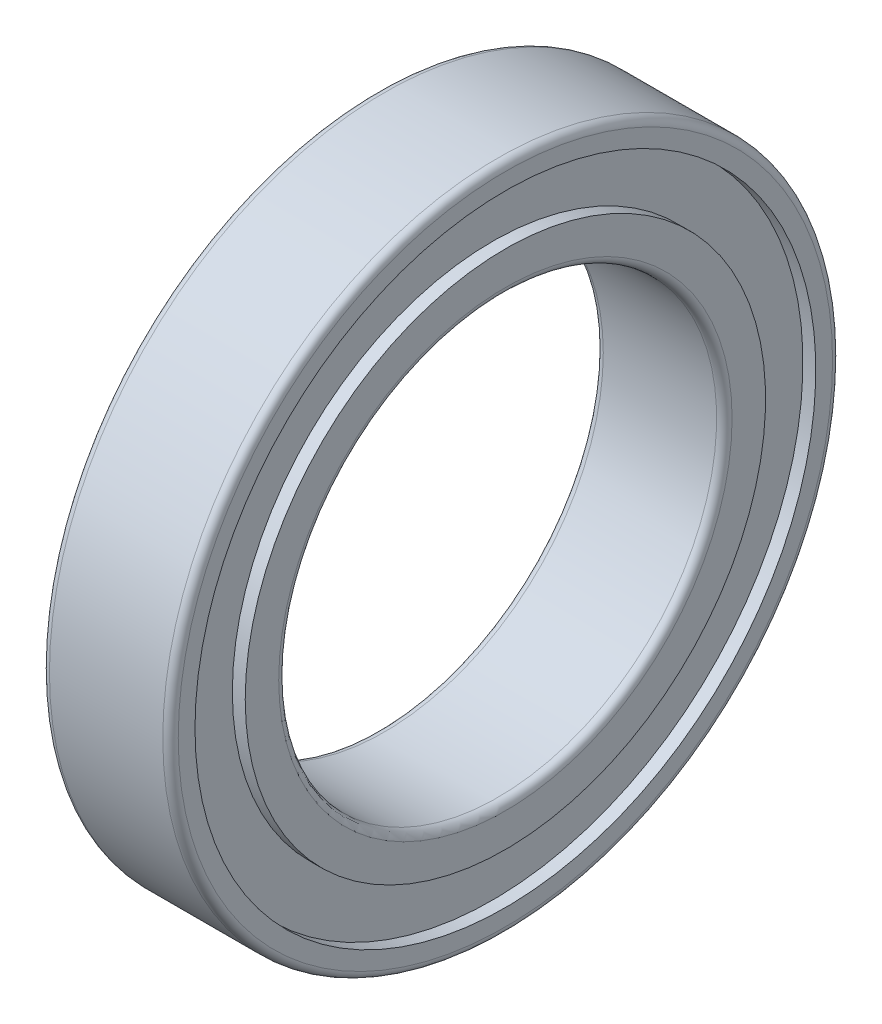
ISO-10303-21;
HEADER;
FILE_DESCRIPTION(('STEP AP214'),'2;1');
FILE_NAME('part.step','',(''),(''),'','','');
FILE_SCHEMA(('AUTOMOTIVE_DESIGN { 1 0 10303 214 1 1 1 1 }'));
ENDSEC;
DATA;
#1=APPLICATION_CONTEXT('core data for automotive mechanical design processes');
#2=APPLICATION_PROTOCOL_DEFINITION('international standard','automotive_design',2000,#1);
#3=PRODUCT_CONTEXT('',#1,'mechanical');
#4=PRODUCT('Part','Part','',(#3));
#5=PRODUCT_RELATED_PRODUCT_CATEGORY('part','',(#4));
#6=PRODUCT_DEFINITION_FORMATION('','',#4);
#7=PRODUCT_DEFINITION_CONTEXT('part definition',#1,'design');
#8=PRODUCT_DEFINITION('design','',#6,#7);
#9=PRODUCT_DEFINITION_SHAPE('','',#8);
#10=(LENGTH_UNIT() NAMED_UNIT(*) SI_UNIT(.MILLI.,.METRE.));
#11=(NAMED_UNIT(*) PLANE_ANGLE_UNIT() SI_UNIT($,.RADIAN.));
#12=(NAMED_UNIT(*) SI_UNIT($,.STERADIAN.) SOLID_ANGLE_UNIT());
#13=UNCERTAINTY_MEASURE_WITH_UNIT(LENGTH_MEASURE(1.E-05),#10,'distance_accuracy_value','');
#14=(GEOMETRIC_REPRESENTATION_CONTEXT(3) GLOBAL_UNCERTAINTY_ASSIGNED_CONTEXT((#13)) GLOBAL_UNIT_ASSIGNED_CONTEXT((#10,
#11,#12)) REPRESENTATION_CONTEXT('',''));
#15=CARTESIAN_POINT('',(0.,0.,0.));
#16=DIRECTION('',(0.,0.,1.));
#17=DIRECTION('',(1.,0.,0.));
#18=AXIS2_PLACEMENT_3D('',#15,#16,#17);
#19=CARTESIAN_POINT('',(0.,0.,0.));
#20=DIRECTION('',(-1.,0.,0.));
#21=DIRECTION('',(0.,0.,1.));
#22=AXIS2_PLACEMENT_3D('',#19,#20,#21);
#23=CYLINDRICAL_SURFACE('',#22,8.5);
#24=CARTESIAN_POINT('',(4.7,0.,0.));
#25=DIRECTION('',(-1.,0.,0.));
#26=DIRECTION('',(0.,0.,1.));
#27=AXIS2_PLACEMENT_3D('',#24,#25,#26);
#28=CIRCLE('',#27,8.5);
#29=CARTESIAN_POINT('',(4.7,0.,8.5));
#30=VERTEX_POINT('',#29);
#31=EDGE_CURVE('E259',#30,#30,#28,.T.);
#32=ORIENTED_EDGE('',*,*,#31,.F.);
#33=EDGE_LOOP('',(#32));
#34=FACE_BOUND('',#33,.T.);
#35=CARTESIAN_POINT('',(0.3,0.,0.));
#36=DIRECTION('',(1.,0.,0.));
#37=DIRECTION('',(0.,0.,-1.));
#38=AXIS2_PLACEMENT_3D('',#35,#36,#37);
#39=CIRCLE('',#38,8.5);
#40=CARTESIAN_POINT('',(0.3,0.,-8.5));
#41=VERTEX_POINT('',#40);
#42=EDGE_CURVE('E64',#41,#41,#39,.T.);
#43=ORIENTED_EDGE('',*,*,#42,.F.);
#44=EDGE_LOOP('',(#43));
#45=FACE_BOUND('',#44,.T.);
#46=ADVANCED_FACE('F17',(#34,#45),#23,.F.);
#47=CARTESIAN_POINT('',(4.7,0.,0.));
#48=DIRECTION('',(-1.,0.,0.));
#49=DIRECTION('',(0.,0.,1.));
#50=AXIS2_PLACEMENT_3D('',#47,#48,#49);
#51=TOROIDAL_SURFACE('',#50,8.8,0.3);
#52=CARTESIAN_POINT('',(5.,0.,0.));
#53=DIRECTION('',(1.,0.,0.));
#54=DIRECTION('',(0.,0.,1.));
#55=AXIS2_PLACEMENT_3D('',#52,#53,#54);
#56=CIRCLE('',#55,8.8);
#57=CARTESIAN_POINT('',(5.,0.,8.8));
#58=VERTEX_POINT('',#57);
#59=CARTESIAN_POINT('',(5.,0.,-8.8));
#60=VERTEX_POINT('',#59);
#61=EDGE_CURVE('E59',#58,#60,#56,.T.);
#62=ORIENTED_EDGE('',*,*,#61,.T.);
#63=CARTESIAN_POINT('',(5.,0.,0.));
#64=DIRECTION('',(1.,0.,0.));
#65=DIRECTION('',(0.,0.,-1.));
#66=AXIS2_PLACEMENT_3D('',#63,#64,#65);
#67=CIRCLE('',#66,8.8);
#68=EDGE_CURVE('E56',#60,#58,#67,.T.);
#69=ORIENTED_EDGE('',*,*,#68,.T.);
#70=EDGE_LOOP('',(#62,#69));
#71=FACE_BOUND('',#70,.T.);
#72=ORIENTED_EDGE('',*,*,#31,.T.);
#73=EDGE_LOOP('',(#72));
#74=FACE_BOUND('',#73,.T.);
#75=ADVANCED_FACE('F60',(#71,#74),#51,.T.);
#76=CARTESIAN_POINT('',(0.3,0.,0.));
#77=DIRECTION('',(1.,0.,0.));
#78=DIRECTION('',(0.,0.,-1.));
#79=AXIS2_PLACEMENT_3D('',#76,#77,#78);
#80=TOROIDAL_SURFACE('',#79,8.8,0.3);
#81=CARTESIAN_POINT('',(0.,0.,0.));
#82=DIRECTION('',(-1.,0.,0.));
#83=DIRECTION('',(0.,0.,-1.));
#84=AXIS2_PLACEMENT_3D('',#81,#82,#83);
#85=CIRCLE('',#84,8.8);
#86=CARTESIAN_POINT('',(0.,0.,-8.8));
#87=VERTEX_POINT('',#86);
#88=CARTESIAN_POINT('',(0.,0.,8.8));
#89=VERTEX_POINT('',#88);
#90=EDGE_CURVE('E68',#87,#89,#85,.T.);
#91=ORIENTED_EDGE('',*,*,#90,.T.);
#92=CARTESIAN_POINT('',(0.,0.,0.));
#93=DIRECTION('',(-1.,0.,0.));
#94=DIRECTION('',(0.,0.,1.));
#95=AXIS2_PLACEMENT_3D('',#92,#93,#94);
#96=CIRCLE('',#95,8.8);
#97=EDGE_CURVE('E222',#89,#87,#96,.T.);
#98=ORIENTED_EDGE('',*,*,#97,.T.);
#99=EDGE_LOOP('',(#91,#98));
#100=FACE_BOUND('',#99,.T.);
#101=ORIENTED_EDGE('',*,*,#42,.T.);
#102=EDGE_LOOP('',(#101));
#103=FACE_BOUND('',#102,.T.);
#104=ADVANCED_FACE('F89',(#100,#103),#80,.T.);
#105=CARTESIAN_POINT('',(5.,8.5,0.));
#106=DIRECTION('',(-1.,0.,0.));
#107=DIRECTION('',(0.,0.,1.));
#108=AXIS2_PLACEMENT_3D('',#105,#106,#107);
#109=PLANE('',#108);
#110=CARTESIAN_POINT('',(5.,0.,0.));
#111=DIRECTION('',(-1.,0.,0.));
#112=DIRECTION('',(0.,0.,1.));
#113=AXIS2_PLACEMENT_3D('',#110,#111,#112);
#114=CIRCLE('',#113,10.1);
#115=CARTESIAN_POINT('',(5.,0.,10.1));
#116=VERTEX_POINT('',#115);
#117=EDGE_CURVE('E230',#116,#116,#114,.T.);
#118=ORIENTED_EDGE('',*,*,#117,.F.);
#119=EDGE_LOOP('',(#118));
#120=FACE_BOUND('',#119,.T.);
#121=ORIENTED_EDGE('',*,*,#61,.F.);
#122=ORIENTED_EDGE('',*,*,#68,.F.);
#123=EDGE_LOOP('',(#121,#122));
#124=FACE_BOUND('',#123,.T.);
#125=ADVANCED_FACE('F67',(#120,#124),#109,.F.);
#126=CARTESIAN_POINT('',(0.,8.5,0.));
#127=DIRECTION('',(1.,0.,0.));
#128=DIRECTION('',(0.,0.,-1.));
#129=AXIS2_PLACEMENT_3D('',#126,#127,#128);
#130=PLANE('',#129);
#131=CARTESIAN_POINT('',(0.,0.,0.));
#132=DIRECTION('',(-1.,0.,0.));
#133=DIRECTION('',(0.,0.,1.));
#134=AXIS2_PLACEMENT_3D('',#131,#132,#133);
#135=CIRCLE('',#134,10.1);
#136=CARTESIAN_POINT('',(0.,0.,10.1));
#137=VERTEX_POINT('',#136);
#138=EDGE_CURVE('E232',#137,#137,#135,.F.);
#139=ORIENTED_EDGE('',*,*,#138,.F.);
#140=EDGE_LOOP('',(#139));
#141=FACE_BOUND('',#140,.T.);
#142=ORIENTED_EDGE('',*,*,#90,.F.);
#143=ORIENTED_EDGE('',*,*,#97,.F.);
#144=EDGE_LOOP('',(#142,#143));
#145=FACE_BOUND('',#144,.T.);
#146=ADVANCED_FACE('F88',(#141,#145),#130,.F.);
#147=CARTESIAN_POINT('',(0.,0.,0.));
#148=DIRECTION('',(-1.,0.,0.));
#149=DIRECTION('',(0.,0.,1.));
#150=AXIS2_PLACEMENT_3D('',#147,#148,#149);
#151=CYLINDRICAL_SURFACE('',#150,10.1);
#152=CARTESIAN_POINT('',(4.5,0.,0.));
#153=DIRECTION('',(-1.,0.,0.));
#154=DIRECTION('',(0.,0.,1.));
#155=AXIS2_PLACEMENT_3D('',#152,#153,#154);
#156=CIRCLE('',#155,10.1);
#157=CARTESIAN_POINT('',(4.5,0.,10.1));
#158=VERTEX_POINT('',#157);
#159=EDGE_CURVE('E237',#158,#158,#156,.F.);
#160=ORIENTED_EDGE('',*,*,#159,.T.);
#161=EDGE_LOOP('',(#160));
#162=FACE_BOUND('',#161,.T.);
#163=ORIENTED_EDGE('',*,*,#117,.T.);
#164=EDGE_LOOP('',(#163));
#165=FACE_BOUND('',#164,.T.);
#166=ADVANCED_FACE('F272',(#162,#165),#151,.T.);
#167=CARTESIAN_POINT('',(0.,0.,0.));
#168=DIRECTION('',(-1.,0.,0.));
#169=DIRECTION('',(0.,0.,1.));
#170=AXIS2_PLACEMENT_3D('',#167,#168,#169);
#171=CYLINDRICAL_SURFACE('',#170,10.1);
#172=ORIENTED_EDGE('',*,*,#138,.T.);
#173=EDGE_LOOP('',(#172));
#174=FACE_BOUND('',#173,.T.);
#175=CARTESIAN_POINT('',(0.5,0.,0.));
#176=DIRECTION('',(-1.,0.,0.));
#177=DIRECTION('',(0.,0.,1.));
#178=AXIS2_PLACEMENT_3D('',#175,#176,#177);
#179=CIRCLE('',#178,10.1);
#180=CARTESIAN_POINT('',(0.5,0.,10.1));
#181=VERTEX_POINT('',#180);
#182=EDGE_CURVE('E267',#181,#181,#179,.T.);
#183=ORIENTED_EDGE('',*,*,#182,.T.);
#184=EDGE_LOOP('',(#183));
#185=FACE_BOUND('',#184,.T.);
#186=ADVANCED_FACE('F278',(#174,#185),#171,.T.);
#187=CARTESIAN_POINT('',(4.5,12.05,0.));
#188=DIRECTION('',(-1.,0.,0.));
#189=DIRECTION('',(0.,0.,1.));
#190=AXIS2_PLACEMENT_3D('',#187,#188,#189);
#191=PLANE('',#190);
#192=ORIENTED_EDGE('',*,*,#159,.F.);
#193=EDGE_LOOP('',(#192));
#194=FACE_BOUND('',#193,.T.);
#195=CARTESIAN_POINT('',(4.5,0.,0.));
#196=DIRECTION('',(-1.,0.,0.));
#197=DIRECTION('',(0.,0.,1.));
#198=AXIS2_PLACEMENT_3D('',#195,#196,#197);
#199=CIRCLE('',#198,12.05);
#200=CARTESIAN_POINT('',(4.5,0.,12.05));
#201=VERTEX_POINT('',#200);
#202=EDGE_CURVE('E264',#201,#201,#199,.F.);
#203=ORIENTED_EDGE('',*,*,#202,.T.);
#204=EDGE_LOOP('',(#203));
#205=FACE_BOUND('',#204,.T.);
#206=ADVANCED_FACE('F274',(#194,#205),#191,.F.);
#207=CARTESIAN_POINT('',(0.5,10.1,0.));
#208=DIRECTION('',(1.,0.,0.));
#209=DIRECTION('',(0.,0.,-1.));
#210=AXIS2_PLACEMENT_3D('',#207,#208,#209);
#211=PLANE('',#210);
#212=CARTESIAN_POINT('',(0.5,0.,0.));
#213=DIRECTION('',(-1.,0.,0.));
#214=DIRECTION('',(0.,0.,1.));
#215=AXIS2_PLACEMENT_3D('',#212,#213,#214);
#216=CIRCLE('',#215,12.05);
#217=CARTESIAN_POINT('',(0.5,0.,12.05));
#218=VERTEX_POINT('',#217);
#219=EDGE_CURVE('E256',#218,#218,#216,.T.);
#220=ORIENTED_EDGE('',*,*,#219,.T.);
#221=EDGE_LOOP('',(#220));
#222=FACE_BOUND('',#221,.T.);
#223=ORIENTED_EDGE('',*,*,#182,.F.);
#224=EDGE_LOOP('',(#223));
#225=FACE_BOUND('',#224,.T.);
#226=ADVANCED_FACE('F277',(#222,#225),#211,.F.);
#227=CARTESIAN_POINT('',(0.,0.,0.));
#228=DIRECTION('',(-1.,0.,0.));
#229=DIRECTION('',(0.,0.,1.));
#230=AXIS2_PLACEMENT_3D('',#227,#228,#229);
#231=CYLINDRICAL_SURFACE('',#230,12.05);
#232=CARTESIAN_POINT('',(5.,0.,0.));
#233=DIRECTION('',(-1.,0.,0.));
#234=DIRECTION('',(0.,0.,1.));
#235=AXIS2_PLACEMENT_3D('',#232,#233,#234);
#236=CIRCLE('',#235,12.05);
#237=CARTESIAN_POINT('',(5.,0.,12.05));
#238=VERTEX_POINT('',#237);
#239=EDGE_CURVE('E251',#238,#238,#236,.F.);
#240=ORIENTED_EDGE('',*,*,#239,.T.);
#241=EDGE_LOOP('',(#240));
#242=FACE_BOUND('',#241,.T.);
#243=ORIENTED_EDGE('',*,*,#202,.F.);
#244=EDGE_LOOP('',(#243));
#245=FACE_BOUND('',#244,.T.);
#246=ADVANCED_FACE('F282',(#242,#245),#231,.F.);
#247=CARTESIAN_POINT('',(0.,0.,0.));
#248=DIRECTION('',(-1.,0.,0.));
#249=DIRECTION('',(0.,0.,1.));
#250=AXIS2_PLACEMENT_3D('',#247,#248,#249);
#251=CYLINDRICAL_SURFACE('',#250,12.05);
#252=ORIENTED_EDGE('',*,*,#219,.F.);
#253=EDGE_LOOP('',(#252));
#254=FACE_BOUND('',#253,.T.);
#255=CARTESIAN_POINT('',(0.,0.,0.));
#256=DIRECTION('',(-1.,0.,0.));
#257=DIRECTION('',(0.,0.,1.));
#258=AXIS2_PLACEMENT_3D('',#255,#256,#257);
#259=CIRCLE('',#258,12.05);
#260=CARTESIAN_POINT('',(0.,0.,12.05));
#261=VERTEX_POINT('',#260);
#262=EDGE_CURVE('E249',#261,#261,#259,.T.);
#263=ORIENTED_EDGE('',*,*,#262,.T.);
#264=EDGE_LOOP('',(#263));
#265=FACE_BOUND('',#264,.T.);
#266=ADVANCED_FACE('F190',(#254,#265),#251,.F.);
#267=CARTESIAN_POINT('',(5.,13.,0.));
#268=DIRECTION('',(-1.,0.,0.));
#269=DIRECTION('',(0.,0.,1.));
#270=AXIS2_PLACEMENT_3D('',#267,#268,#269);
#271=PLANE('',#270);
#272=ORIENTED_EDGE('',*,*,#239,.F.);
#273=EDGE_LOOP('',(#272));
#274=FACE_BOUND('',#273,.T.);
#275=CARTESIAN_POINT('',(5.,0.,0.));
#276=DIRECTION('',(-1.,0.,0.));
#277=DIRECTION('',(0.,0.,1.));
#278=AXIS2_PLACEMENT_3D('',#275,#276,#277);
#279=CIRCLE('',#278,12.7);
#280=CARTESIAN_POINT('',(5.,0.,12.7));
#281=VERTEX_POINT('',#280);
#282=CARTESIAN_POINT('',(5.,0.,-12.7));
#283=VERTEX_POINT('',#282);
#284=EDGE_CURVE('E176',#281,#283,#279,.T.);
#285=ORIENTED_EDGE('',*,*,#284,.F.);
#286=CARTESIAN_POINT('',(5.,0.,0.));
#287=DIRECTION('',(-1.,0.,0.));
#288=DIRECTION('',(0.,0.,-1.));
#289=AXIS2_PLACEMENT_3D('',#286,#287,#288);
#290=CIRCLE('',#289,12.7);
#291=EDGE_CURVE('E248',#283,#281,#290,.T.);
#292=ORIENTED_EDGE('',*,*,#291,.F.);
#293=EDGE_LOOP('',(#285,#292));
#294=FACE_BOUND('',#293,.T.);
#295=ADVANCED_FACE('F181',(#274,#294),#271,.F.);
#296=CARTESIAN_POINT('',(0.,12.05,0.));
#297=DIRECTION('',(1.,0.,0.));
#298=DIRECTION('',(0.,0.,-1.));
#299=AXIS2_PLACEMENT_3D('',#296,#297,#298);
#300=PLANE('',#299);
#301=ORIENTED_EDGE('',*,*,#262,.F.);
#302=EDGE_LOOP('',(#301));
#303=FACE_BOUND('',#302,.T.);
#304=CARTESIAN_POINT('',(0.,0.,0.));
#305=DIRECTION('',(1.,0.,0.));
#306=DIRECTION('',(0.,0.,-1.));
#307=AXIS2_PLACEMENT_3D('',#304,#305,#306);
#308=CIRCLE('',#307,12.7);
#309=CARTESIAN_POINT('',(0.,0.,-12.7));
#310=VERTEX_POINT('',#309);
#311=CARTESIAN_POINT('',(0.,0.,12.7));
#312=VERTEX_POINT('',#311);
#313=EDGE_CURVE('E146',#310,#312,#308,.T.);
#314=ORIENTED_EDGE('',*,*,#313,.F.);
#315=CARTESIAN_POINT('',(0.,0.,0.));
#316=DIRECTION('',(1.,0.,0.));
#317=DIRECTION('',(0.,0.,1.));
#318=AXIS2_PLACEMENT_3D('',#315,#316,#317);
#319=CIRCLE('',#318,12.7);
#320=EDGE_CURVE('E35',#312,#310,#319,.T.);
#321=ORIENTED_EDGE('',*,*,#320,.F.);
#322=EDGE_LOOP('',(#314,#321));
#323=FACE_BOUND('',#322,.T.);
#324=ADVANCED_FACE('F132',(#303,#323),#300,.F.);
#325=CARTESIAN_POINT('',(4.7,0.,0.));
#326=DIRECTION('',(-1.,0.,0.));
#327=DIRECTION('',(0.,0.,1.));
#328=AXIS2_PLACEMENT_3D('',#325,#326,#327);
#329=TOROIDAL_SURFACE('',#328,12.7,0.3);
#330=CARTESIAN_POINT('',(4.7,0.,0.));
#331=DIRECTION('',(-1.,0.,0.));
#332=DIRECTION('',(0.,0.,1.));
#333=AXIS2_PLACEMENT_3D('',#330,#331,#332);
#334=CIRCLE('',#333,13.);
#335=CARTESIAN_POINT('',(4.7,0.,13.));
#336=VERTEX_POINT('',#335);
#337=EDGE_CURVE('E27',#336,#336,#334,.T.);
#338=ORIENTED_EDGE('',*,*,#337,.F.);
#339=EDGE_LOOP('',(#338));
#340=FACE_BOUND('',#339,.T.);
#341=ORIENTED_EDGE('',*,*,#284,.T.);
#342=ORIENTED_EDGE('',*,*,#291,.T.);
#343=EDGE_LOOP('',(#341,#342));
#344=FACE_BOUND('',#343,.T.);
#345=ADVANCED_FACE('F120',(#340,#344),#329,.T.);
#346=CARTESIAN_POINT('',(0.3,0.,0.));
#347=DIRECTION('',(1.,0.,0.));
#348=DIRECTION('',(0.,0.,-1.));
#349=AXIS2_PLACEMENT_3D('',#346,#347,#348);
#350=TOROIDAL_SURFACE('',#349,12.7,0.3);
#351=CARTESIAN_POINT('',(0.3,0.,0.));
#352=DIRECTION('',(-1.,0.,0.));
#353=DIRECTION('',(0.,0.,1.));
#354=AXIS2_PLACEMENT_3D('',#351,#352,#353);
#355=CIRCLE('',#354,13.);
#356=CARTESIAN_POINT('',(0.3,0.,13.));
#357=VERTEX_POINT('',#356);
#358=EDGE_CURVE('E11',#357,#357,#355,.F.);
#359=ORIENTED_EDGE('',*,*,#358,.F.);
#360=EDGE_LOOP('',(#359));
#361=FACE_BOUND('',#360,.T.);
#362=ORIENTED_EDGE('',*,*,#313,.T.);
#363=ORIENTED_EDGE('',*,*,#320,.T.);
#364=EDGE_LOOP('',(#362,#363));
#365=FACE_BOUND('',#364,.T.);
#366=ADVANCED_FACE('F131',(#361,#365),#350,.T.);
#367=CARTESIAN_POINT('',(0.,0.,0.));
#368=DIRECTION('',(-1.,0.,0.));
#369=DIRECTION('',(0.,0.,1.));
#370=AXIS2_PLACEMENT_3D('',#367,#368,#369);
#371=CYLINDRICAL_SURFACE('',#370,13.);
#372=ORIENTED_EDGE('',*,*,#358,.T.);
#373=EDGE_LOOP('',(#372));
#374=FACE_BOUND('',#373,.T.);
#375=ORIENTED_EDGE('',*,*,#337,.T.);
#376=EDGE_LOOP('',(#375));
#377=FACE_BOUND('',#376,.T.);
#378=ADVANCED_FACE('F293',(#374,#377),#371,.T.);
#379=CLOSED_SHELL('',(#46,#75,#104,#125,#146,#166,#186,#206,#226,#246,#266,#295,#324,#345,#366,#378));
#380=MANIFOLD_SOLID_BREP('B1',#379);
#381=ADVANCED_BREP_SHAPE_REPRESENTATION('',(#18,#380),#14);
#382=SHAPE_DEFINITION_REPRESENTATION(#9,#381);
ENDSEC;
END-ISO-10303-21;
